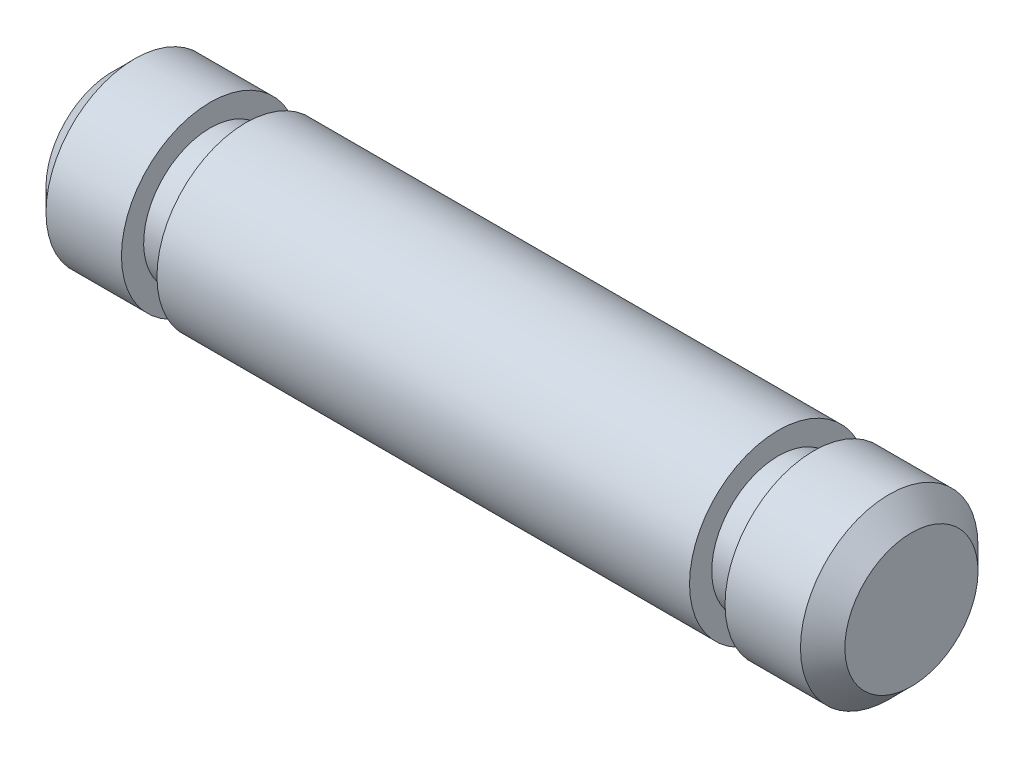
ISO-10303-21;
HEADER;
FILE_DESCRIPTION(('STEP AP214'),'2;1');
FILE_NAME('part.step','',(''),(''),'','','');
FILE_SCHEMA(('AUTOMOTIVE_DESIGN { 1 0 10303 214 1 1 1 1 }'));
ENDSEC;
DATA;
#1=APPLICATION_CONTEXT('core data for automotive mechanical design processes');
#2=APPLICATION_PROTOCOL_DEFINITION('international standard','automotive_design',2000,#1);
#3=PRODUCT_CONTEXT('',#1,'mechanical');
#4=PRODUCT('Part','Part','',(#3));
#5=PRODUCT_RELATED_PRODUCT_CATEGORY('part','',(#4));
#6=PRODUCT_DEFINITION_FORMATION('','',#4);
#7=PRODUCT_DEFINITION_CONTEXT('part definition',#1,'design');
#8=PRODUCT_DEFINITION('design','',#6,#7);
#9=PRODUCT_DEFINITION_SHAPE('','',#8);
#10=(LENGTH_UNIT() NAMED_UNIT(*) SI_UNIT(.MILLI.,.METRE.));
#11=(NAMED_UNIT(*) PLANE_ANGLE_UNIT() SI_UNIT($,.RADIAN.));
#12=(NAMED_UNIT(*) SI_UNIT($,.STERADIAN.) SOLID_ANGLE_UNIT());
#13=UNCERTAINTY_MEASURE_WITH_UNIT(LENGTH_MEASURE(1.E-05),#10,'distance_accuracy_value','');
#14=(GEOMETRIC_REPRESENTATION_CONTEXT(3) GLOBAL_UNCERTAINTY_ASSIGNED_CONTEXT((#13)) GLOBAL_UNIT_ASSIGNED_CONTEXT((#10,
#11,#12)) REPRESENTATION_CONTEXT('',''));
#15=CARTESIAN_POINT('',(0.,0.,0.));
#16=DIRECTION('',(0.,0.,1.));
#17=DIRECTION('',(1.,0.,0.));
#18=AXIS2_PLACEMENT_3D('',#15,#16,#17);
#19=CARTESIAN_POINT('',(-7.16724522687825,0.,0.));
#20=DIRECTION('',(-1.,0.,0.));
#21=DIRECTION('',(0.,-1.,0.));
#22=AXIS2_PLACEMENT_3D('',#19,#20,#21);
#23=PLANE('',#22);
#24=CARTESIAN_POINT('',(-7.16724522687825,0.,0.));
#25=DIRECTION('',(-1.,0.,0.));
#26=DIRECTION('',(0.,-1.,0.));
#27=AXIS2_PLACEMENT_3D('',#24,#25,#26);
#28=CIRCLE('',#27,1.49999999999999);
#29=CARTESIAN_POINT('',(-7.16724522687825,-1.49999999999999,0.));
#30=VERTEX_POINT('',#29);
#31=EDGE_CURVE('E10',#30,#30,#28,.T.);
#32=ORIENTED_EDGE('',*,*,#31,.T.);
#33=EDGE_LOOP('',(#32));
#34=FACE_BOUND('',#33,.T.);
#35=ADVANCED_FACE('F33',(#34),#23,.T.);
#36=CARTESIAN_POINT('',(10.8327547731217,0.,0.));
#37=DIRECTION('',(1.,0.,0.));
#38=DIRECTION('',(0.,1.,0.));
#39=AXIS2_PLACEMENT_3D('',#36,#37,#38);
#40=CYLINDRICAL_SURFACE('',#39,2.);
#41=CARTESIAN_POINT('',(-6.66724522687825,0.,0.));
#42=DIRECTION('',(-1.,0.,0.));
#43=DIRECTION('',(0.,-1.,0.));
#44=AXIS2_PLACEMENT_3D('',#41,#42,#43);
#45=CIRCLE('',#44,2.);
#46=CARTESIAN_POINT('',(-6.66724522687825,-2.,0.));
#47=VERTEX_POINT('',#46);
#48=EDGE_CURVE('E41',#47,#47,#45,.F.);
#49=ORIENTED_EDGE('',*,*,#48,.T.);
#50=EDGE_LOOP('',(#49));
#51=FACE_BOUND('',#50,.T.);
#52=CARTESIAN_POINT('',(-4.96724522687825,0.,0.));
#53=DIRECTION('',(1.,0.,0.));
#54=DIRECTION('',(0.,1.,0.));
#55=AXIS2_PLACEMENT_3D('',#52,#53,#54);
#56=CIRCLE('',#55,2.);
#57=CARTESIAN_POINT('',(-4.96724522687825,2.,0.));
#58=VERTEX_POINT('',#57);
#59=EDGE_CURVE('E54',#58,#58,#56,.T.);
#60=ORIENTED_EDGE('',*,*,#59,.F.);
#61=EDGE_LOOP('',(#60));
#62=FACE_BOUND('',#61,.T.);
#63=ADVANCED_FACE('F97',(#51,#62),#40,.T.);
#64=CARTESIAN_POINT('',(-4.96724522687825,2.,0.));
#65=DIRECTION('',(1.,0.,0.));
#66=DIRECTION('',(0.,1.,0.));
#67=AXIS2_PLACEMENT_3D('',#64,#65,#66);
#68=PLANE('',#67);
#69=ORIENTED_EDGE('',*,*,#59,.T.);
#70=EDGE_LOOP('',(#69));
#71=FACE_BOUND('',#70,.T.);
#72=CARTESIAN_POINT('',(-4.96724522687825,0.,0.));
#73=DIRECTION('',(1.,0.,0.));
#74=DIRECTION('',(0.,1.,0.));
#75=AXIS2_PLACEMENT_3D('',#72,#73,#74);
#76=CIRCLE('',#75,1.5);
#77=CARTESIAN_POINT('',(-4.96724522687825,1.5,0.));
#78=VERTEX_POINT('',#77);
#79=EDGE_CURVE('E57',#78,#78,#76,.T.);
#80=ORIENTED_EDGE('',*,*,#79,.F.);
#81=EDGE_LOOP('',(#80));
#82=FACE_BOUND('',#81,.T.);
#83=ADVANCED_FACE('F102',(#71,#82),#68,.T.);
#84=CARTESIAN_POINT('',(10.8327547731217,0.,0.));
#85=DIRECTION('',(1.,0.,0.));
#86=DIRECTION('',(0.,1.,0.));
#87=AXIS2_PLACEMENT_3D('',#84,#85,#86);
#88=CYLINDRICAL_SURFACE('',#87,1.5);
#89=ORIENTED_EDGE('',*,*,#79,.T.);
#90=EDGE_LOOP('',(#89));
#91=FACE_BOUND('',#90,.T.);
#92=CARTESIAN_POINT('',(-4.16724522687825,0.,0.));
#93=DIRECTION('',(1.,0.,0.));
#94=DIRECTION('',(0.,1.,0.));
#95=AXIS2_PLACEMENT_3D('',#92,#93,#94);
#96=CIRCLE('',#95,1.5);
#97=CARTESIAN_POINT('',(-4.16724522687825,1.5,0.));
#98=VERTEX_POINT('',#97);
#99=EDGE_CURVE('E60',#98,#98,#96,.T.);
#100=ORIENTED_EDGE('',*,*,#99,.F.);
#101=EDGE_LOOP('',(#100));
#102=FACE_BOUND('',#101,.T.);
#103=ADVANCED_FACE('F178',(#91,#102),#88,.T.);
#104=CARTESIAN_POINT('',(-4.16724522687825,1.5,0.));
#105=DIRECTION('',(-1.,0.,0.));
#106=DIRECTION('',(0.,-1.,0.));
#107=AXIS2_PLACEMENT_3D('',#104,#105,#106);
#108=PLANE('',#107);
#109=ORIENTED_EDGE('',*,*,#99,.T.);
#110=EDGE_LOOP('',(#109));
#111=FACE_BOUND('',#110,.T.);
#112=CARTESIAN_POINT('',(-4.16724522687825,0.,0.));
#113=DIRECTION('',(1.,0.,0.));
#114=DIRECTION('',(0.,1.,0.));
#115=AXIS2_PLACEMENT_3D('',#112,#113,#114);
#116=CIRCLE('',#115,2.);
#117=CARTESIAN_POINT('',(-4.16724522687825,2.,0.));
#118=VERTEX_POINT('',#117);
#119=EDGE_CURVE('E63',#118,#118,#116,.T.);
#120=ORIENTED_EDGE('',*,*,#119,.F.);
#121=EDGE_LOOP('',(#120));
#122=FACE_BOUND('',#121,.T.);
#123=ADVANCED_FACE('F168',(#111,#122),#108,.T.);
#124=CARTESIAN_POINT('',(10.8327547731217,0.,0.));
#125=DIRECTION('',(1.,0.,0.));
#126=DIRECTION('',(0.,1.,0.));
#127=AXIS2_PLACEMENT_3D('',#124,#125,#126);
#128=CYLINDRICAL_SURFACE('',#127,2.);
#129=ORIENTED_EDGE('',*,*,#119,.T.);
#130=EDGE_LOOP('',(#129));
#131=FACE_BOUND('',#130,.T.);
#132=CARTESIAN_POINT('',(7.83275477312175,0.,0.));
#133=DIRECTION('',(1.,0.,0.));
#134=DIRECTION('',(0.,1.,0.));
#135=AXIS2_PLACEMENT_3D('',#132,#133,#134);
#136=CIRCLE('',#135,2.);
#137=CARTESIAN_POINT('',(7.83275477312175,2.,0.));
#138=VERTEX_POINT('',#137);
#139=EDGE_CURVE('E66',#138,#138,#136,.T.);
#140=ORIENTED_EDGE('',*,*,#139,.F.);
#141=EDGE_LOOP('',(#140));
#142=FACE_BOUND('',#141,.T.);
#143=ADVANCED_FACE('F158',(#131,#142),#128,.T.);
#144=CARTESIAN_POINT('',(7.83275477312175,2.,0.));
#145=DIRECTION('',(1.,0.,0.));
#146=DIRECTION('',(0.,1.,0.));
#147=AXIS2_PLACEMENT_3D('',#144,#145,#146);
#148=PLANE('',#147);
#149=ORIENTED_EDGE('',*,*,#139,.T.);
#150=EDGE_LOOP('',(#149));
#151=FACE_BOUND('',#150,.T.);
#152=CARTESIAN_POINT('',(7.83275477312175,0.,0.));
#153=DIRECTION('',(1.,0.,0.));
#154=DIRECTION('',(0.,1.,0.));
#155=AXIS2_PLACEMENT_3D('',#152,#153,#154);
#156=CIRCLE('',#155,1.5);
#157=CARTESIAN_POINT('',(7.83275477312175,1.5,0.));
#158=VERTEX_POINT('',#157);
#159=EDGE_CURVE('E69',#158,#158,#156,.T.);
#160=ORIENTED_EDGE('',*,*,#159,.F.);
#161=EDGE_LOOP('',(#160));
#162=FACE_BOUND('',#161,.T.);
#163=ADVANCED_FACE('F93',(#151,#162),#148,.T.);
#164=CARTESIAN_POINT('',(10.8327547731217,0.,0.));
#165=DIRECTION('',(1.,0.,0.));
#166=DIRECTION('',(0.,1.,0.));
#167=AXIS2_PLACEMENT_3D('',#164,#165,#166);
#168=CYLINDRICAL_SURFACE('',#167,1.5);
#169=ORIENTED_EDGE('',*,*,#159,.T.);
#170=EDGE_LOOP('',(#169));
#171=FACE_BOUND('',#170,.T.);
#172=CARTESIAN_POINT('',(8.63275477312175,0.,0.));
#173=DIRECTION('',(1.,0.,0.));
#174=DIRECTION('',(0.,1.,0.));
#175=AXIS2_PLACEMENT_3D('',#172,#173,#174);
#176=CIRCLE('',#175,1.5);
#177=CARTESIAN_POINT('',(8.63275477312175,1.5,0.));
#178=VERTEX_POINT('',#177);
#179=EDGE_CURVE('E72',#178,#178,#176,.T.);
#180=ORIENTED_EDGE('',*,*,#179,.F.);
#181=EDGE_LOOP('',(#180));
#182=FACE_BOUND('',#181,.T.);
#183=ADVANCED_FACE('F83',(#171,#182),#168,.T.);
#184=CARTESIAN_POINT('',(8.63275477312175,1.5,0.));
#185=DIRECTION('',(-1.,0.,0.));
#186=DIRECTION('',(0.,-1.,0.));
#187=AXIS2_PLACEMENT_3D('',#184,#185,#186);
#188=PLANE('',#187);
#189=ORIENTED_EDGE('',*,*,#179,.T.);
#190=EDGE_LOOP('',(#189));
#191=FACE_BOUND('',#190,.T.);
#192=CARTESIAN_POINT('',(8.63275477312175,0.,0.));
#193=DIRECTION('',(1.,0.,0.));
#194=DIRECTION('',(0.,1.,0.));
#195=AXIS2_PLACEMENT_3D('',#192,#193,#194);
#196=CIRCLE('',#195,2.);
#197=CARTESIAN_POINT('',(8.63275477312175,2.,0.));
#198=VERTEX_POINT('',#197);
#199=EDGE_CURVE('E75',#198,#198,#196,.T.);
#200=ORIENTED_EDGE('',*,*,#199,.F.);
#201=EDGE_LOOP('',(#200));
#202=FACE_BOUND('',#201,.T.);
#203=ADVANCED_FACE('F81',(#191,#202),#188,.T.);
#204=CARTESIAN_POINT('',(10.8327547731217,0.,0.));
#205=DIRECTION('',(1.,0.,0.));
#206=DIRECTION('',(0.,1.,0.));
#207=AXIS2_PLACEMENT_3D('',#204,#205,#206);
#208=CYLINDRICAL_SURFACE('',#207,2.);
#209=CARTESIAN_POINT('',(10.3327547731217,0.,0.));
#210=DIRECTION('',(1.,0.,0.));
#211=DIRECTION('',(0.,1.,0.));
#212=AXIS2_PLACEMENT_3D('',#209,#210,#211);
#213=CIRCLE('',#212,2.);
#214=CARTESIAN_POINT('',(10.3327547731217,2.,0.));
#215=VERTEX_POINT('',#214);
#216=EDGE_CURVE('E45',#215,#215,#213,.F.);
#217=ORIENTED_EDGE('',*,*,#216,.T.);
#218=EDGE_LOOP('',(#217));
#219=FACE_BOUND('',#218,.T.);
#220=ORIENTED_EDGE('',*,*,#199,.T.);
#221=EDGE_LOOP('',(#220));
#222=FACE_BOUND('',#221,.T.);
#223=ADVANCED_FACE('F79',(#219,#222),#208,.T.);
#224=CARTESIAN_POINT('',(10.8327547731217,2.,0.));
#225=DIRECTION('',(1.,0.,0.));
#226=DIRECTION('',(0.,1.,0.));
#227=AXIS2_PLACEMENT_3D('',#224,#225,#226);
#228=PLANE('',#227);
#229=CARTESIAN_POINT('',(10.8327547731217,0.,0.));
#230=DIRECTION('',(1.,0.,0.));
#231=DIRECTION('',(0.,1.,0.));
#232=AXIS2_PLACEMENT_3D('',#229,#230,#231);
#233=CIRCLE('',#232,1.5);
#234=CARTESIAN_POINT('',(10.8327547731217,1.5,0.));
#235=VERTEX_POINT('',#234);
#236=EDGE_CURVE('E49',#235,#235,#233,.T.);
#237=ORIENTED_EDGE('',*,*,#236,.T.);
#238=EDGE_LOOP('',(#237));
#239=FACE_BOUND('',#238,.T.);
#240=ADVANCED_FACE('F90',(#239),#228,.T.);
#241=CARTESIAN_POINT('',(10.8327547731217,0.,0.));
#242=DIRECTION('',(-1.,0.,0.));
#243=DIRECTION('',(0.,-1.,0.));
#244=AXIS2_PLACEMENT_3D('',#241,#242,#243);
#245=CONICAL_SURFACE('',#244,1.5,0.785398163397447);
#246=ORIENTED_EDGE('',*,*,#216,.F.);
#247=EDGE_LOOP('',(#246));
#248=FACE_BOUND('',#247,.T.);
#249=ORIENTED_EDGE('',*,*,#236,.F.);
#250=EDGE_LOOP('',(#249));
#251=FACE_BOUND('',#250,.T.);
#252=ADVANCED_FACE('F106',(#248,#251),#245,.T.);
#253=CARTESIAN_POINT('',(-6.66724522687825,0.,0.));
#254=DIRECTION('',(1.,0.,0.));
#255=DIRECTION('',(0.,1.,0.));
#256=AXIS2_PLACEMENT_3D('',#253,#254,#255);
#257=CONICAL_SURFACE('',#256,2.,0.78539816339745);
#258=ORIENTED_EDGE('',*,*,#31,.F.);
#259=EDGE_LOOP('',(#258));
#260=FACE_BOUND('',#259,.T.);
#261=ORIENTED_EDGE('',*,*,#48,.F.);
#262=EDGE_LOOP('',(#261));
#263=FACE_BOUND('',#262,.T.);
#264=ADVANCED_FACE('F36',(#260,#263),#257,.T.);
#265=CLOSED_SHELL('',(#35,#63,#83,#103,#123,#143,#163,#183,#203,#223,#240,#252,#264));
#266=MANIFOLD_SOLID_BREP('B2',#265);
#267=ADVANCED_BREP_SHAPE_REPRESENTATION('',(#18,#266),#14);
#268=SHAPE_DEFINITION_REPRESENTATION(#9,#267);
ENDSEC;
END-ISO-10303-21;
